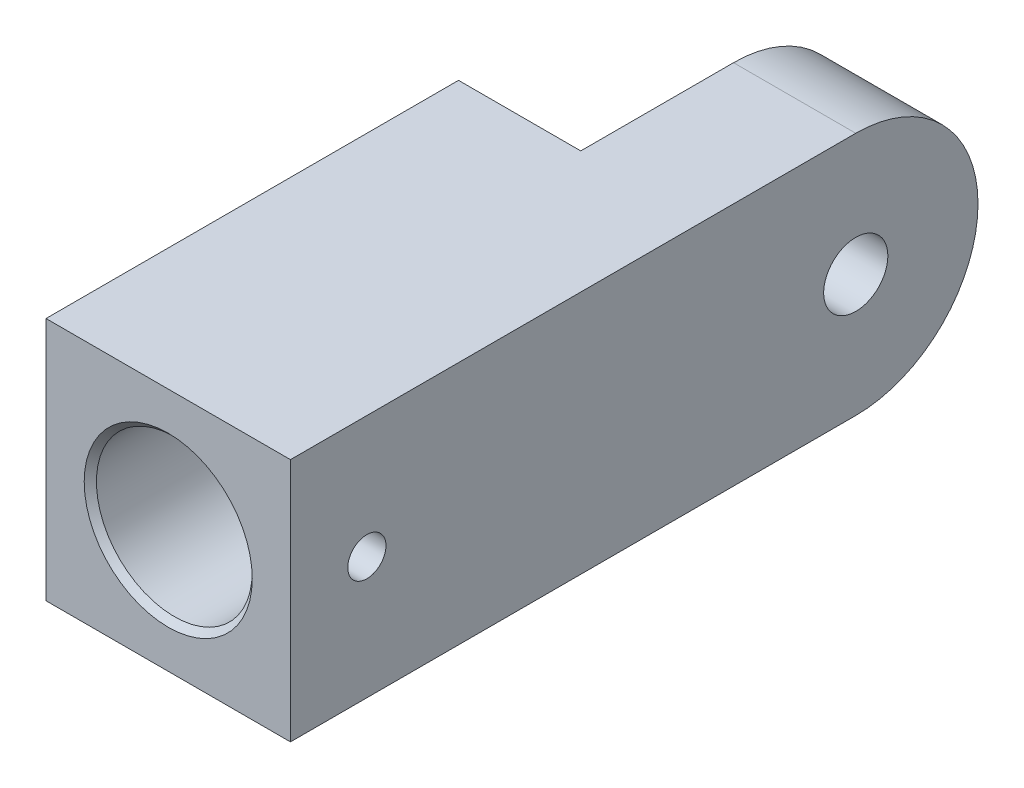
ISO-10303-21;
HEADER;
FILE_DESCRIPTION(('STEP AP214'),'2;1');
FILE_NAME('part.step','',(''),(''),'','','');
FILE_SCHEMA(('AUTOMOTIVE_DESIGN { 1 0 10303 214 1 1 1 1 }'));
ENDSEC;
DATA;
#1=APPLICATION_CONTEXT('core data for automotive mechanical design processes');
#2=APPLICATION_PROTOCOL_DEFINITION('international standard','automotive_design',2000,#1);
#3=PRODUCT_CONTEXT('',#1,'mechanical');
#4=PRODUCT('Part','Part','',(#3));
#5=PRODUCT_RELATED_PRODUCT_CATEGORY('part','',(#4));
#6=PRODUCT_DEFINITION_FORMATION('','',#4);
#7=PRODUCT_DEFINITION_CONTEXT('part definition',#1,'design');
#8=PRODUCT_DEFINITION('design','',#6,#7);
#9=PRODUCT_DEFINITION_SHAPE('','',#8);
#10=(LENGTH_UNIT() NAMED_UNIT(*) SI_UNIT(.MILLI.,.METRE.));
#11=(NAMED_UNIT(*) PLANE_ANGLE_UNIT() SI_UNIT($,.RADIAN.));
#12=(NAMED_UNIT(*) SI_UNIT($,.STERADIAN.) SOLID_ANGLE_UNIT());
#13=UNCERTAINTY_MEASURE_WITH_UNIT(LENGTH_MEASURE(1.E-05),#10,'distance_accuracy_value','');
#14=(GEOMETRIC_REPRESENTATION_CONTEXT(3) GLOBAL_UNCERTAINTY_ASSIGNED_CONTEXT((#13)) GLOBAL_UNIT_ASSIGNED_CONTEXT((#10,
#11,#12)) REPRESENTATION_CONTEXT('',''));
#15=CARTESIAN_POINT('',(0.,0.,0.));
#16=DIRECTION('',(0.,0.,1.));
#17=DIRECTION('',(1.,0.,0.));
#18=AXIS2_PLACEMENT_3D('',#15,#16,#17);
#19=CARTESIAN_POINT('',(8.,8.,45.));
#20=DIRECTION('',(0.,-1.,0.));
#21=DIRECTION('',(1.,0.,0.));
#22=AXIS2_PLACEMENT_3D('',#19,#20,#21);
#23=PLANE('',#22);
#24=DIRECTION('',(-1.,0.,0.));
#25=VECTOR('',#24,1.);
#26=CARTESIAN_POINT('',(8.,8.,8.));
#27=LINE('',#26,#25);
#28=CARTESIAN_POINT('',(8.,8.,8.));
#29=VERTEX_POINT('',#28);
#30=CARTESIAN_POINT('',(0.,8.,8.));
#31=VERTEX_POINT('',#30);
#32=EDGE_CURVE('E126',#29,#31,#27,.T.);
#33=ORIENTED_EDGE('',*,*,#32,.T.);
#34=DIRECTION('',(0.,0.,-1.));
#35=VECTOR('',#34,1.);
#36=CARTESIAN_POINT('',(0.,8.,0.));
#37=LINE('',#36,#35);
#38=CARTESIAN_POINT('',(0.,8.,18.));
#39=VERTEX_POINT('',#38);
#40=EDGE_CURVE('E140',#39,#31,#37,.T.);
#41=ORIENTED_EDGE('',*,*,#40,.F.);
#42=DIRECTION('',(1.,0.,0.));
#43=VECTOR('',#42,1.);
#44=CARTESIAN_POINT('',(-8.,8.,18.));
#45=LINE('',#44,#43);
#46=CARTESIAN_POINT('',(-8.,8.,18.));
#47=VERTEX_POINT('',#46);
#48=EDGE_CURVE('E136',#47,#39,#45,.T.);
#49=ORIENTED_EDGE('',*,*,#48,.F.);
#50=DIRECTION('',(0.,0.,-1.));
#51=VECTOR('',#50,1.);
#52=CARTESIAN_POINT('',(-8.,8.,45.));
#53=LINE('',#52,#51);
#54=CARTESIAN_POINT('',(-8.,8.,45.));
#55=VERTEX_POINT('',#54);
#56=EDGE_CURVE('E155',#55,#47,#53,.T.);
#57=ORIENTED_EDGE('',*,*,#56,.F.);
#58=DIRECTION('',(-1.,0.,0.));
#59=VECTOR('',#58,1.);
#60=CARTESIAN_POINT('',(8.,8.,45.));
#61=LINE('',#60,#59);
#62=CARTESIAN_POINT('',(8.,8.,45.));
#63=VERTEX_POINT('',#62);
#64=EDGE_CURVE('E60',#63,#55,#61,.T.);
#65=ORIENTED_EDGE('',*,*,#64,.F.);
#66=DIRECTION('',(0.,0.,-1.));
#67=VECTOR('',#66,1.);
#68=CARTESIAN_POINT('',(8.,8.,45.));
#69=LINE('',#68,#67);
#70=EDGE_CURVE('E158',#63,#29,#69,.T.);
#71=ORIENTED_EDGE('',*,*,#70,.T.);
#72=EDGE_LOOP('',(#33,#41,#49,#57,#65,#71));
#73=FACE_BOUND('',#72,.T.);
#74=ADVANCED_FACE('F38',(#73),#23,.F.);
#75=CARTESIAN_POINT('',(-8.,8.,45.));
#76=DIRECTION('',(1.,0.,0.));
#77=DIRECTION('',(0.,1.,0.));
#78=AXIS2_PLACEMENT_3D('',#75,#76,#77);
#79=PLANE('',#78);
#80=ORIENTED_EDGE('',*,*,#56,.T.);
#81=DIRECTION('',(0.,-1.,0.));
#82=VECTOR('',#81,1.);
#83=CARTESIAN_POINT('',(-8.,0.,18.));
#84=LINE('',#83,#82);
#85=CARTESIAN_POINT('',(-8.,-8.,18.));
#86=VERTEX_POINT('',#85);
#87=EDGE_CURVE('E133',#47,#86,#84,.T.);
#88=ORIENTED_EDGE('',*,*,#87,.T.);
#89=DIRECTION('',(0.,0.,-1.));
#90=VECTOR('',#89,1.);
#91=CARTESIAN_POINT('',(-8.,-8.,45.));
#92=LINE('',#91,#90);
#93=CARTESIAN_POINT('',(-8.,-8.,45.));
#94=VERTEX_POINT('',#93);
#95=EDGE_CURVE('E52',#94,#86,#92,.T.);
#96=ORIENTED_EDGE('',*,*,#95,.F.);
#97=DIRECTION('',(0.,-1.,0.));
#98=VECTOR('',#97,1.);
#99=CARTESIAN_POINT('',(-8.,8.,45.));
#100=LINE('',#99,#98);
#101=EDGE_CURVE('E148',#55,#94,#100,.T.);
#102=ORIENTED_EDGE('',*,*,#101,.F.);
#103=EDGE_LOOP('',(#80,#88,#96,#102));
#104=FACE_BOUND('',#103,.T.);
#105=ADVANCED_FACE('F40',(#104),#79,.F.);
#106=CARTESIAN_POINT('',(8.,-8.,45.));
#107=DIRECTION('',(0.,1.,0.));
#108=DIRECTION('',(-1.,0.,0.));
#109=AXIS2_PLACEMENT_3D('',#106,#107,#108);
#110=PLANE('',#109);
#111=DIRECTION('',(0.,0.,-1.));
#112=VECTOR('',#111,1.);
#113=CARTESIAN_POINT('',(0.,-8.,0.));
#114=LINE('',#113,#112);
#115=CARTESIAN_POINT('',(0.,-8.,18.));
#116=VERTEX_POINT('',#115);
#117=CARTESIAN_POINT('',(0.,-8.,8.));
#118=VERTEX_POINT('',#117);
#119=EDGE_CURVE('E132',#116,#118,#114,.T.);
#120=ORIENTED_EDGE('',*,*,#119,.T.);
#121=DIRECTION('',(-1.,0.,0.));
#122=VECTOR('',#121,1.);
#123=CARTESIAN_POINT('',(8.,-8.,8.));
#124=LINE('',#123,#122);
#125=CARTESIAN_POINT('',(8.,-8.,8.));
#126=VERTEX_POINT('',#125);
#127=EDGE_CURVE('E129',#126,#118,#124,.T.);
#128=ORIENTED_EDGE('',*,*,#127,.F.);
#129=DIRECTION('',(0.,0.,-1.));
#130=VECTOR('',#129,1.);
#131=CARTESIAN_POINT('',(8.,-8.,45.));
#132=LINE('',#131,#130);
#133=CARTESIAN_POINT('',(8.,-8.,45.));
#134=VERTEX_POINT('',#133);
#135=EDGE_CURVE('E161',#134,#126,#132,.T.);
#136=ORIENTED_EDGE('',*,*,#135,.F.);
#137=DIRECTION('',(1.,0.,0.));
#138=VECTOR('',#137,1.);
#139=CARTESIAN_POINT('',(8.,-8.,45.));
#140=LINE('',#139,#138);
#141=EDGE_CURVE('E151',#94,#134,#140,.T.);
#142=ORIENTED_EDGE('',*,*,#141,.F.);
#143=ORIENTED_EDGE('',*,*,#95,.T.);
#144=DIRECTION('',(1.,0.,0.));
#145=VECTOR('',#144,1.);
#146=CARTESIAN_POINT('',(-8.,-8.,18.));
#147=LINE('',#146,#145);
#148=EDGE_CURVE('E145',#86,#116,#147,.T.);
#149=ORIENTED_EDGE('',*,*,#148,.T.);
#150=EDGE_LOOP('',(#120,#128,#136,#142,#143,#149));
#151=FACE_BOUND('',#150,.T.);
#152=ADVANCED_FACE('F190',(#151),#110,.F.);
#153=CARTESIAN_POINT('',(8.,8.,45.));
#154=DIRECTION('',(-1.,0.,0.));
#155=DIRECTION('',(0.,0.,1.));
#156=AXIS2_PLACEMENT_3D('',#153,#154,#155);
#157=PLANE('',#156);
#158=CARTESIAN_POINT('',(8.,0.,40.));
#159=DIRECTION('',(1.,0.,0.));
#160=DIRECTION('',(0.,0.,-1.));
#161=AXIS2_PLACEMENT_3D('',#158,#159,#160);
#162=CIRCLE('',#161,1.25);
#163=CARTESIAN_POINT('',(8.,0.,38.75));
#164=VERTEX_POINT('',#163);
#165=EDGE_CURVE('E111',#164,#164,#162,.T.);
#166=ORIENTED_EDGE('',*,*,#165,.F.);
#167=EDGE_LOOP('',(#166));
#168=FACE_BOUND('',#167,.T.);
#169=CARTESIAN_POINT('',(8.,0.,8.));
#170=DIRECTION('',(1.,0.,0.));
#171=DIRECTION('',(0.,0.,-1.));
#172=AXIS2_PLACEMENT_3D('',#169,#170,#171);
#173=CIRCLE('',#172,2.1);
#174=CARTESIAN_POINT('',(8.,0.,5.9));
#175=VERTEX_POINT('',#174);
#176=EDGE_CURVE('E119',#175,#175,#173,.T.);
#177=ORIENTED_EDGE('',*,*,#176,.F.);
#178=EDGE_LOOP('',(#177));
#179=FACE_BOUND('',#178,.T.);
#180=ORIENTED_EDGE('',*,*,#135,.T.);
#181=CARTESIAN_POINT('',(8.,0.,8.));
#182=DIRECTION('',(1.,0.,0.));
#183=DIRECTION('',(0.,0.,-1.));
#184=AXIS2_PLACEMENT_3D('',#181,#182,#183);
#185=CIRCLE('',#184,8.);
#186=EDGE_CURVE('E123',#126,#29,#185,.T.);
#187=ORIENTED_EDGE('',*,*,#186,.T.);
#188=ORIENTED_EDGE('',*,*,#70,.F.);
#189=DIRECTION('',(0.,1.,0.));
#190=VECTOR('',#189,1.);
#191=CARTESIAN_POINT('',(8.,8.,45.));
#192=LINE('',#191,#190);
#193=EDGE_CURVE('E65',#134,#63,#192,.T.);
#194=ORIENTED_EDGE('',*,*,#193,.F.);
#195=EDGE_LOOP('',(#180,#187,#188,#194));
#196=FACE_BOUND('',#195,.T.);
#197=ADVANCED_FACE('F196',(#168,#179,#196),#157,.F.);
#198=CARTESIAN_POINT('',(0.,0.,45.));
#199=DIRECTION('',(0.,0.,-1.));
#200=DIRECTION('',(-1.,0.,0.));
#201=AXIS2_PLACEMENT_3D('',#198,#199,#200);
#202=PLANE('',#201);
#203=CARTESIAN_POINT('',(0.,0.,45.));
#204=DIRECTION('',(0.,0.,1.));
#205=DIRECTION('',(1.,0.,0.));
#206=AXIS2_PLACEMENT_3D('',#203,#204,#205);
#207=CIRCLE('',#206,5.5);
#208=CARTESIAN_POINT('',(5.5,0.,45.));
#209=VERTEX_POINT('',#208);
#210=EDGE_CURVE('E113',#209,#209,#207,.T.);
#211=ORIENTED_EDGE('',*,*,#210,.F.);
#212=EDGE_LOOP('',(#211));
#213=FACE_BOUND('',#212,.T.);
#214=ORIENTED_EDGE('',*,*,#101,.T.);
#215=ORIENTED_EDGE('',*,*,#141,.T.);
#216=ORIENTED_EDGE('',*,*,#193,.T.);
#217=ORIENTED_EDGE('',*,*,#64,.T.);
#218=EDGE_LOOP('',(#214,#215,#216,#217));
#219=FACE_BOUND('',#218,.T.);
#220=ADVANCED_FACE('F194',(#213,#219),#202,.F.);
#221=CARTESIAN_POINT('',(-8.,0.,18.));
#222=DIRECTION('',(0.,0.,1.));
#223=DIRECTION('',(0.,-1.,0.));
#224=AXIS2_PLACEMENT_3D('',#221,#222,#223);
#225=PLANE('',#224);
#226=DIRECTION('',(0.,-1.,0.));
#227=VECTOR('',#226,1.);
#228=CARTESIAN_POINT('',(0.,0.,18.));
#229=LINE('',#228,#227);
#230=EDGE_CURVE('E137',#39,#116,#229,.T.);
#231=ORIENTED_EDGE('',*,*,#230,.T.);
#232=ORIENTED_EDGE('',*,*,#148,.F.);
#233=ORIENTED_EDGE('',*,*,#87,.F.);
#234=ORIENTED_EDGE('',*,*,#48,.T.);
#235=EDGE_LOOP('',(#231,#232,#233,#234));
#236=FACE_BOUND('',#235,.T.);
#237=ADVANCED_FACE('F208',(#236),#225,.F.);
#238=CARTESIAN_POINT('',(0.,0.,0.));
#239=DIRECTION('',(1.,0.,0.));
#240=DIRECTION('',(0.,0.,-1.));
#241=AXIS2_PLACEMENT_3D('',#238,#239,#240);
#242=PLANE('',#241);
#243=CARTESIAN_POINT('',(0.,0.,8.));
#244=DIRECTION('',(1.,0.,0.));
#245=DIRECTION('',(0.,0.,-1.));
#246=AXIS2_PLACEMENT_3D('',#243,#244,#245);
#247=CIRCLE('',#246,2.1);
#248=CARTESIAN_POINT('',(0.,0.,5.9));
#249=VERTEX_POINT('',#248);
#250=EDGE_CURVE('E122',#249,#249,#247,.T.);
#251=ORIENTED_EDGE('',*,*,#250,.T.);
#252=EDGE_LOOP('',(#251));
#253=FACE_BOUND('',#252,.T.);
#254=CARTESIAN_POINT('',(0.,0.,8.));
#255=DIRECTION('',(1.,0.,0.));
#256=DIRECTION('',(0.,0.,-1.));
#257=AXIS2_PLACEMENT_3D('',#254,#255,#256);
#258=CIRCLE('',#257,8.);
#259=EDGE_CURVE('E11',#31,#118,#258,.F.);
#260=ORIENTED_EDGE('',*,*,#259,.T.);
#261=ORIENTED_EDGE('',*,*,#119,.F.);
#262=ORIENTED_EDGE('',*,*,#230,.F.);
#263=ORIENTED_EDGE('',*,*,#40,.T.);
#264=EDGE_LOOP('',(#260,#261,#262,#263));
#265=FACE_BOUND('',#264,.T.);
#266=ADVANCED_FACE('F168',(#253,#265),#242,.F.);
#267=CARTESIAN_POINT('',(8.,0.,8.));
#268=DIRECTION('',(-1.,0.,0.));
#269=DIRECTION('',(0.,0.,1.));
#270=AXIS2_PLACEMENT_3D('',#267,#268,#269);
#271=CYLINDRICAL_SURFACE('',#270,8.);
#272=ORIENTED_EDGE('',*,*,#259,.F.);
#273=ORIENTED_EDGE('',*,*,#32,.F.);
#274=ORIENTED_EDGE('',*,*,#186,.F.);
#275=ORIENTED_EDGE('',*,*,#127,.T.);
#276=EDGE_LOOP('',(#272,#273,#274,#275));
#277=FACE_BOUND('',#276,.T.);
#278=ADVANCED_FACE('F174',(#277),#271,.T.);
#279=CARTESIAN_POINT('',(8.,0.,8.));
#280=DIRECTION('',(1.,0.,0.));
#281=DIRECTION('',(0.,0.,-1.));
#282=AXIS2_PLACEMENT_3D('',#279,#280,#281);
#283=CYLINDRICAL_SURFACE('',#282,2.1);
#284=ORIENTED_EDGE('',*,*,#176,.T.);
#285=EDGE_LOOP('',(#284));
#286=FACE_BOUND('',#285,.T.);
#287=ORIENTED_EDGE('',*,*,#250,.F.);
#288=EDGE_LOOP('',(#287));
#289=FACE_BOUND('',#288,.T.);
#290=ADVANCED_FACE('F171',(#286,#289),#283,.F.);
#291=CARTESIAN_POINT('',(8.,0.,40.));
#292=DIRECTION('',(1.,0.,0.));
#293=DIRECTION('',(0.,0.,-1.));
#294=AXIS2_PLACEMENT_3D('',#291,#292,#293);
#295=CYLINDRICAL_SURFACE('',#294,1.25);
#296=CARTESIAN_POINT('',(5.1,0.,38.75));
#297=CARTESIAN_POINT('',(5.09999880434979,-0.0691070684996925,38.7500020165109));
#298=CARTESIAN_POINT('',(5.09858131536653,-0.138236944418446,38.7557502377163));
#299=CARTESIAN_POINT('',(5.09306394414273,-0.274518328542682,38.7785585629587));
#300=CARTESIAN_POINT('',(5.08896247642348,-0.34166864286499,38.7956253531758));
#301=CARTESIAN_POINT('',(5.07853173481307,-0.472002952228093,38.8404925553834));
#302=CARTESIAN_POINT('',(5.07220508043732,-0.535191508483105,38.8682803501969));
#303=CARTESIAN_POINT('',(5.05799923545459,-0.656009783807288,38.9337570747495));
#304=CARTESIAN_POINT('',(5.05012000732641,-0.71363936848209,38.9714462437834));
#305=CARTESIAN_POINT('',(5.03349079831523,-0.822848252966838,39.0564464383293));
#306=CARTESIAN_POINT('',(5.02472780422834,-0.874301457474937,39.1039169353936));
#307=CARTESIAN_POINT('',(5.00740600303306,-0.96860149051342,39.2067906907256));
#308=CARTESIAN_POINT('',(4.99884721820992,-1.01144738348377,39.2621948102078));
#309=CARTESIAN_POINT('',(4.98277220490615,-1.0879035028578,39.3803344515879));
#310=CARTESIAN_POINT('',(4.9752725239875,-1.1213738013313,39.4431629859324));
#311=CARTESIAN_POINT('',(4.96235417524496,-1.17722916418205,39.5737681418392));
#312=CARTESIAN_POINT('',(4.95693518890104,-1.1996159254181,39.6415440041553));
#313=CARTESIAN_POINT('',(4.94892534918552,-1.23224077227212,39.7787363247121));
#314=CARTESIAN_POINT('',(4.94628192270403,-1.24270502580646,39.8480958595413));
#315=CARTESIAN_POINT('',(4.94396505119134,-1.2518920997985,39.9876324709265));
#316=CARTESIAN_POINT('',(4.94429114286616,-1.25061675182797,40.0578094182464));
#317=CARTESIAN_POINT('',(4.94782914866116,-1.23654152995141,40.1952641722533));
#318=CARTESIAN_POINT('',(4.9509738595344,-1.22401001756152,40.2625714574792));
#319=CARTESIAN_POINT('',(4.95968781619626,-1.18820580162089,40.3940980498247));
#320=CARTESIAN_POINT('',(4.9652572287173,-1.16493235940441,40.4583171442504));
#321=CARTESIAN_POINT('',(4.97825548132943,-1.10807335491485,40.5825697258023));
#322=CARTESIAN_POINT('',(4.98570192341189,-1.07438945055791,40.6425562921717));
#323=CARTESIAN_POINT('',(5.00160513396375,-0.997734518212737,40.7561224624407));
#324=CARTESIAN_POINT('',(5.01006207277567,-0.954761923411034,40.8097009830617));
#325=CARTESIAN_POINT('',(5.02731725106061,-0.859354317594717,40.9104692771806));
#326=CARTESIAN_POINT('',(5.03611849726846,-0.806692545166492,40.9574440979085));
#327=CARTESIAN_POINT('',(5.05286158733432,-0.694134178054512,41.0419355926126));
#328=CARTESIAN_POINT('',(5.06080340690474,-0.634237379008401,41.0794519993317));
#329=CARTESIAN_POINT('',(5.07496988361232,-0.50860985961295,41.1440363033431));
#330=CARTESIAN_POINT('',(5.0811889683056,-0.44286109577459,41.1710704042116));
#331=CARTESIAN_POINT('',(5.09116862078237,-0.307566171137276,41.2136431882088));
#332=CARTESIAN_POINT('',(5.09492964005614,-0.238020710248735,41.2291839824637));
#333=CARTESIAN_POINT('',(5.09950300203925,-0.0989453142746352,41.2480033211648));
#334=CARTESIAN_POINT('',(5.10038575477826,-0.0294572667514434,41.2515747305345));
#335=CARTESIAN_POINT('',(5.09930312829893,0.109123373763242,41.2471556093645));
#336=CARTESIAN_POINT('',(5.09733799487026,0.178216000365267,41.2391660766036));
#337=CARTESIAN_POINT('',(5.09082541313748,0.313034626367916,41.2120935472766));
#338=CARTESIAN_POINT('',(5.08631494103106,0.378794452619996,41.1931693073307));
#339=CARTESIAN_POINT('',(5.07521932825952,0.506203454443049,41.1449450407605));
#340=CARTESIAN_POINT('',(5.06863398290122,0.567852223717143,41.1156439903937));
#341=CARTESIAN_POINT('',(5.05394953642363,0.686461955962984,41.0469233066112));
#342=CARTESIAN_POINT('',(5.04582634854577,0.743324059126191,41.0073383135403));
#343=CARTESIAN_POINT('',(5.02900694161716,0.849702675725456,40.9193858033341));
#344=CARTESIAN_POINT('',(5.02031062787397,0.899217970898001,40.8710168325714));
#345=CARTESIAN_POINT('',(5.00307328773868,0.990696382723899,40.7655119086836));
#346=CARTESIAN_POINT('',(4.99454072619954,1.03245444963733,40.7081964929428));
#347=CARTESIAN_POINT('',(4.9788261359557,1.10575822346969,40.5871978735137));
#348=CARTESIAN_POINT('',(4.97164404691532,1.13730438667597,40.5235149545041));
#349=CARTESIAN_POINT('',(4.95952136957446,1.1890561697623,40.3919339822122));
#350=CARTESIAN_POINT('',(4.95456754355924,1.20932893763629,40.3240636215546));
#351=CARTESIAN_POINT('',(4.94744732527486,1.2381394598066,40.1857387366966));
#352=CARTESIAN_POINT('',(4.94528035148441,1.24667966231571,40.115284754767));
#353=CARTESIAN_POINT('',(4.94402228162177,1.25165848529287,39.97587576824));
#354=CARTESIAN_POINT('',(4.94484800382851,1.2484243607539,39.9069330109691));
#355=CARTESIAN_POINT('',(4.94929065899866,1.2306924450603,39.7706079014838));
#356=CARTESIAN_POINT('',(4.952907540025,1.21619486349272,39.7032255202586));
#357=CARTESIAN_POINT('',(4.96247954352292,1.17652305640476,39.5722739046824));
#358=CARTESIAN_POINT('',(4.9684217046624,1.15140795267151,39.5086857472011));
#359=CARTESIAN_POINT('',(4.98197703107666,1.09126121671283,39.3865812546914));
#360=CARTESIAN_POINT('',(4.98959041906046,1.05622826264648,39.3280655970794));
#361=CARTESIAN_POINT('',(5.00586943046763,0.976204563183662,39.2161804005758));
#362=CARTESIAN_POINT('',(5.01455668828479,0.930985706061678,39.1629771336555));
#363=CARTESIAN_POINT('',(5.03187294207899,0.832321323332238,39.0648072134256));
#364=CARTESIAN_POINT('',(5.04050192381697,0.778873858036758,39.0198425076377));
#365=CARTESIAN_POINT('',(5.05690655619084,0.664158652901534,38.9386730795966));
#366=CARTESIAN_POINT('',(5.0646649532915,0.602772094362,38.9026325414743));
#367=CARTESIAN_POINT('',(5.07827391506525,0.474628080310969,38.8414399612351));
#368=CARTESIAN_POINT('',(5.08412588542531,0.407874627519971,38.8162798919975));
#369=CARTESIAN_POINT('',(5.09236742668302,0.28433916851994,38.7814229674574));
#370=CARTESIAN_POINT('',(5.09521030945108,0.228160130166595,38.7696643112467));
#371=CARTESIAN_POINT('',(5.09902702732158,0.114659241633676,38.7539522615779));
#372=CARTESIAN_POINT('',(5.10000099201949,0.0573374709725584,38.7499983269203));
#373=CARTESIAN_POINT('',(5.1,0.,38.75));
#374=B_SPLINE_CURVE_WITH_KNOTS('',3,(#296,#297,#298,#299,#300,#301,#302,#303,#304,#305,#306,
#307,#308,#309,#310,#311,#312,#313,#314,#315,#316,#317,#318,#319,#320,#321,#322,#323,#324,#325,
#326,#327,#328,#329,#330,#331,#332,#333,#334,#335,#336,#337,#338,#339,#340,#341,#342,#343,#344,
#345,#346,#347,#348,#349,#350,#351,#352,#353,#354,#355,#356,#357,#358,#359,#360,#361,#362,#363,
#364,#365,#366,#367,#368,#369,#370,#371,#372,#373),.UNSPECIFIED.,.T.,.F.,(4,2,2,2,2,2,2,2,2,2,2,
2,2,2,2,2,2,2,2,2,2,2,2,2,2,2,2,2,2,2,2,2,2,2,2,2,2,2,4),(0.,0.207111126001138,
0.414344707167141,0.621335142633991,0.82833058107301,1.03901413705268,1.2497205806197,
1.46342191841654,1.67709052900647,1.88663462873633,2.09614603667921,2.30079124414468,
2.50545052607679,2.71210547153033,2.91879530271747,3.1311412630626,3.34349322278761,
3.55652425234779,3.76951614198416,3.97725697741624,4.1849798846347,4.38976012844558,
4.59456058084085,4.80288334137089,5.01124060791518,5.22449909344892,5.4377480488709,
5.64971283372679,5.8616333815604,6.06770935164209,6.27378148721519,6.47872095452596,
6.68368774882848,6.89380526695211,7.10397239106231,7.31775867260691,7.53138696205187,
7.70323699097113,7.87507510294715),.UNSPECIFIED.);
#375=CARTESIAN_POINT('',(5.1,0.,38.75));
#376=VERTEX_POINT('',#375);
#377=EDGE_CURVE('E42',#376,#376,#374,.T.);
#378=ORIENTED_EDGE('',*,*,#377,.T.);
#379=EDGE_LOOP('',(#378));
#380=FACE_BOUND('',#379,.T.);
#381=ORIENTED_EDGE('',*,*,#165,.T.);
#382=EDGE_LOOP('',(#381));
#383=FACE_BOUND('',#382,.T.);
#384=ADVANCED_FACE('F173',(#380,#383),#295,.F.);
#385=CARTESIAN_POINT('',(0.,0.,45.));
#386=DIRECTION('',(0.,0.,1.));
#387=DIRECTION('',(1.,0.,0.));
#388=AXIS2_PLACEMENT_3D('',#385,#386,#387);
#389=CYLINDRICAL_SURFACE('',#388,5.1);
#390=CARTESIAN_POINT('',(0.,0.,44.6));
#391=DIRECTION('',(0.,0.,1.));
#392=DIRECTION('',(1.,0.,0.));
#393=AXIS2_PLACEMENT_3D('',#390,#391,#392);
#394=CIRCLE('',#393,5.1);
#395=CARTESIAN_POINT('',(5.1,0.,44.6));
#396=VERTEX_POINT('',#395);
#397=EDGE_CURVE('E108',#396,#396,#394,.T.);
#398=ORIENTED_EDGE('',*,*,#397,.T.);
#399=EDGE_LOOP('',(#398));
#400=FACE_BOUND('',#399,.T.);
#401=CARTESIAN_POINT('',(0.,0.,33.0643891570406));
#402=DIRECTION('',(0.,0.,1.));
#403=DIRECTION('',(1.,0.,0.));
#404=AXIS2_PLACEMENT_3D('',#401,#402,#403);
#405=CIRCLE('',#404,5.1);
#406=CARTESIAN_POINT('',(5.1,0.,33.0643891570406));
#407=VERTEX_POINT('',#406);
#408=EDGE_CURVE('E106',#407,#407,#405,.T.);
#409=ORIENTED_EDGE('',*,*,#408,.F.);
#410=EDGE_LOOP('',(#409));
#411=FACE_BOUND('',#410,.T.);
#412=ORIENTED_EDGE('',*,*,#377,.F.);
#413=EDGE_LOOP('',(#412));
#414=FACE_BOUND('',#413,.T.);
#415=ADVANCED_FACE('F102',(#400,#411,#414),#389,.F.);
#416=CARTESIAN_POINT('',(0.,0.,33.0643891570406));
#417=DIRECTION('',(0.,0.,1.));
#418=DIRECTION('',(1.,0.,0.));
#419=AXIS2_PLACEMENT_3D('',#416,#417,#418);
#420=CONICAL_SURFACE('',#419,5.1,1.02974425867665);
#421=CARTESIAN_POINT('',(0.,0.,30.));
#422=VERTEX_POINT('',#421);
#423=VERTEX_LOOP('',#422);
#424=FACE_BOUND('',#423,.T.);
#425=ORIENTED_EDGE('',*,*,#408,.T.);
#426=EDGE_LOOP('',(#425));
#427=FACE_BOUND('',#426,.T.);
#428=ADVANCED_FACE('F98',(#424,#427),#420,.F.);
#429=CARTESIAN_POINT('',(0.,0.,45.));
#430=DIRECTION('',(0.,0.,1.));
#431=DIRECTION('',(1.,0.,0.));
#432=AXIS2_PLACEMENT_3D('',#429,#430,#431);
#433=CONICAL_SURFACE('',#432,5.5,0.785398163397453);
#434=ORIENTED_EDGE('',*,*,#397,.F.);
#435=EDGE_LOOP('',(#434));
#436=FACE_BOUND('',#435,.T.);
#437=ORIENTED_EDGE('',*,*,#210,.T.);
#438=EDGE_LOOP('',(#437));
#439=FACE_BOUND('',#438,.T.);
#440=ADVANCED_FACE('F101',(#436,#439),#433,.F.);
#441=CLOSED_SHELL('',(#74,#105,#152,#197,#220,#237,#266,#278,#290,#384,#415,#428,#440));
#442=MANIFOLD_SOLID_BREP('B2',#441);
#443=ADVANCED_BREP_SHAPE_REPRESENTATION('',(#18,#442),#14);
#444=SHAPE_DEFINITION_REPRESENTATION(#9,#443);
ENDSEC;
END-ISO-10303-21;
